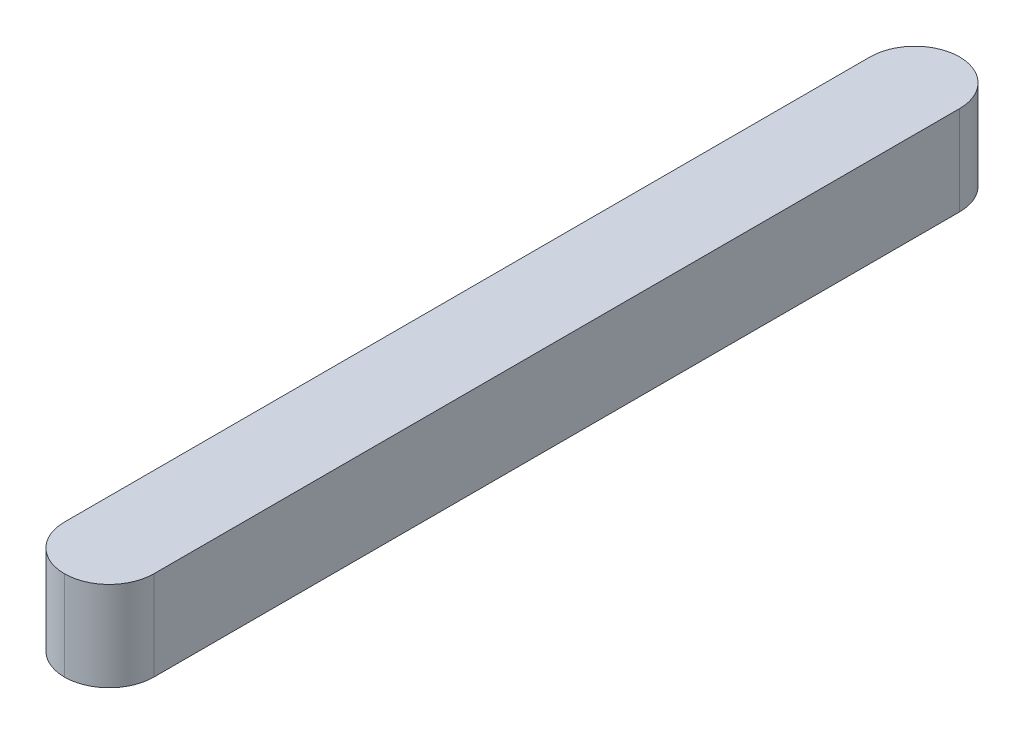
ISO-10303-21;
HEADER;
FILE_DESCRIPTION(('STEP AP214'),'2;1');
FILE_NAME('part.step','',(''),(''),'','','');
FILE_SCHEMA(('AUTOMOTIVE_DESIGN { 1 0 10303 214 1 1 1 1 }'));
ENDSEC;
DATA;
#1=APPLICATION_CONTEXT('core data for automotive mechanical design processes');
#2=APPLICATION_PROTOCOL_DEFINITION('international standard','automotive_design',2000,#1);
#3=PRODUCT_CONTEXT('',#1,'mechanical');
#4=PRODUCT('Part','Part','',(#3));
#5=PRODUCT_RELATED_PRODUCT_CATEGORY('part','',(#4));
#6=PRODUCT_DEFINITION_FORMATION('','',#4);
#7=PRODUCT_DEFINITION_CONTEXT('part definition',#1,'design');
#8=PRODUCT_DEFINITION('design','',#6,#7);
#9=PRODUCT_DEFINITION_SHAPE('','',#8);
#10=(LENGTH_UNIT() NAMED_UNIT(*) SI_UNIT(.MILLI.,.METRE.));
#11=(NAMED_UNIT(*) PLANE_ANGLE_UNIT() SI_UNIT($,.RADIAN.));
#12=(NAMED_UNIT(*) SI_UNIT($,.STERADIAN.) SOLID_ANGLE_UNIT());
#13=UNCERTAINTY_MEASURE_WITH_UNIT(LENGTH_MEASURE(1.E-05),#10,'distance_accuracy_value','');
#14=(GEOMETRIC_REPRESENTATION_CONTEXT(3) GLOBAL_UNCERTAINTY_ASSIGNED_CONTEXT((#13)) GLOBAL_UNIT_ASSIGNED_CONTEXT((#10,
#11,#12)) REPRESENTATION_CONTEXT('',''));
#15=CARTESIAN_POINT('',(0.,0.,0.));
#16=DIRECTION('',(0.,0.,1.));
#17=DIRECTION('',(1.,0.,0.));
#18=AXIS2_PLACEMENT_3D('',#15,#16,#17);
#19=CARTESIAN_POINT('',(1.,-1.,10.));
#20=DIRECTION('',(-1.,0.,0.));
#21=DIRECTION('',(0.,0.,1.));
#22=AXIS2_PLACEMENT_3D('',#19,#20,#21);
#23=PLANE('',#22);
#24=DIRECTION('',(0.,0.,-1.));
#25=VECTOR('',#24,1.);
#26=CARTESIAN_POINT('',(1.,-1.,10.));
#27=LINE('',#26,#25);
#28=CARTESIAN_POINT('',(1.,-1.,9.));
#29=VERTEX_POINT('',#28);
#30=CARTESIAN_POINT('',(1.,-1.,-9.));
#31=VERTEX_POINT('',#30);
#32=EDGE_CURVE('E11',#29,#31,#27,.T.);
#33=ORIENTED_EDGE('',*,*,#32,.T.);
#34=DIRECTION('',(0.,1.,0.));
#35=VECTOR('',#34,1.);
#36=CARTESIAN_POINT('',(1.,1.,-9.));
#37=LINE('',#36,#35);
#38=CARTESIAN_POINT('',(1.,1.,-9.));
#39=VERTEX_POINT('',#38);
#40=EDGE_CURVE('E27',#31,#39,#37,.T.);
#41=ORIENTED_EDGE('',*,*,#40,.T.);
#42=DIRECTION('',(0.,0.,-1.));
#43=VECTOR('',#42,1.);
#44=CARTESIAN_POINT('',(1.,1.,10.));
#45=LINE('',#44,#43);
#46=CARTESIAN_POINT('',(1.,1.,9.));
#47=VERTEX_POINT('',#46);
#48=EDGE_CURVE('E97',#47,#39,#45,.T.);
#49=ORIENTED_EDGE('',*,*,#48,.F.);
#50=DIRECTION('',(0.,-1.,0.));
#51=VECTOR('',#50,1.);
#52=CARTESIAN_POINT('',(1.,-1.,9.));
#53=LINE('',#52,#51);
#54=EDGE_CURVE('E93',#47,#29,#53,.T.);
#55=ORIENTED_EDGE('',*,*,#54,.T.);
#56=EDGE_LOOP('',(#33,#41,#49,#55));
#57=FACE_BOUND('',#56,.T.);
#58=ADVANCED_FACE('F16',(#57),#23,.F.);
#59=CARTESIAN_POINT('',(-1.,1.,10.));
#60=DIRECTION('',(0.,-1.,0.));
#61=DIRECTION('',(0.,0.,-1.));
#62=AXIS2_PLACEMENT_3D('',#59,#60,#61);
#63=PLANE('',#62);
#64=CARTESIAN_POINT('',(0.,1.,-9.));
#65=DIRECTION('',(0.,1.,0.));
#66=DIRECTION('',(0.,0.,-1.));
#67=AXIS2_PLACEMENT_3D('',#64,#65,#66);
#68=CIRCLE('',#67,1.);
#69=CARTESIAN_POINT('',(0.,1.,-10.));
#70=VERTEX_POINT('',#69);
#71=EDGE_CURVE('E106',#39,#70,#68,.T.);
#72=ORIENTED_EDGE('',*,*,#71,.T.);
#73=CARTESIAN_POINT('',(0.,1.,-9.));
#74=DIRECTION('',(0.,1.,0.));
#75=DIRECTION('',(0.,0.,-1.));
#76=AXIS2_PLACEMENT_3D('',#73,#74,#75);
#77=CIRCLE('',#76,1.);
#78=CARTESIAN_POINT('',(-1.,1.,-9.));
#79=VERTEX_POINT('',#78);
#80=EDGE_CURVE('E117',#70,#79,#77,.T.);
#81=ORIENTED_EDGE('',*,*,#80,.T.);
#82=DIRECTION('',(0.,0.,-1.));
#83=VECTOR('',#82,1.);
#84=CARTESIAN_POINT('',(-1.,1.,10.));
#85=LINE('',#84,#83);
#86=CARTESIAN_POINT('',(-1.,1.,9.));
#87=VERTEX_POINT('',#86);
#88=EDGE_CURVE('E74',#87,#79,#85,.T.);
#89=ORIENTED_EDGE('',*,*,#88,.F.);
#90=CARTESIAN_POINT('',(0.,1.,9.));
#91=DIRECTION('',(0.,1.,0.));
#92=DIRECTION('',(0.,0.,-1.));
#93=AXIS2_PLACEMENT_3D('',#90,#91,#92);
#94=CIRCLE('',#93,1.);
#95=CARTESIAN_POINT('',(0.,1.,10.));
#96=VERTEX_POINT('',#95);
#97=EDGE_CURVE('E109',#87,#96,#94,.T.);
#98=ORIENTED_EDGE('',*,*,#97,.T.);
#99=CARTESIAN_POINT('',(0.,1.,9.));
#100=DIRECTION('',(0.,1.,0.));
#101=DIRECTION('',(0.,0.,-1.));
#102=AXIS2_PLACEMENT_3D('',#99,#100,#101);
#103=CIRCLE('',#102,1.);
#104=EDGE_CURVE('E86',#96,#47,#103,.T.);
#105=ORIENTED_EDGE('',*,*,#104,.T.);
#106=ORIENTED_EDGE('',*,*,#48,.T.);
#107=EDGE_LOOP('',(#72,#81,#89,#98,#105,#106));
#108=FACE_BOUND('',#107,.T.);
#109=ADVANCED_FACE('F108',(#108),#63,.F.);
#110=CARTESIAN_POINT('',(-1.,-1.,10.));
#111=DIRECTION('',(1.,0.,0.));
#112=DIRECTION('',(0.,1.,0.));
#113=AXIS2_PLACEMENT_3D('',#110,#111,#112);
#114=PLANE('',#113);
#115=ORIENTED_EDGE('',*,*,#88,.T.);
#116=DIRECTION('',(0.,-1.,0.));
#117=VECTOR('',#116,1.);
#118=CARTESIAN_POINT('',(-1.,-1.,-9.));
#119=LINE('',#118,#117);
#120=CARTESIAN_POINT('',(-1.,-1.,-9.));
#121=VERTEX_POINT('',#120);
#122=EDGE_CURVE('E123',#79,#121,#119,.T.);
#123=ORIENTED_EDGE('',*,*,#122,.T.);
#124=DIRECTION('',(0.,0.,-1.));
#125=VECTOR('',#124,1.);
#126=CARTESIAN_POINT('',(-1.,-1.,10.));
#127=LINE('',#126,#125);
#128=CARTESIAN_POINT('',(-1.,-1.,9.));
#129=VERTEX_POINT('',#128);
#130=EDGE_CURVE('E137',#129,#121,#127,.T.);
#131=ORIENTED_EDGE('',*,*,#130,.F.);
#132=DIRECTION('',(0.,1.,0.));
#133=VECTOR('',#132,1.);
#134=CARTESIAN_POINT('',(-1.,-1.,9.));
#135=LINE('',#134,#133);
#136=EDGE_CURVE('E126',#129,#87,#135,.T.);
#137=ORIENTED_EDGE('',*,*,#136,.T.);
#138=EDGE_LOOP('',(#115,#123,#131,#137));
#139=FACE_BOUND('',#138,.T.);
#140=ADVANCED_FACE('F198',(#139),#114,.F.);
#141=CARTESIAN_POINT('',(-1.,-1.,10.));
#142=DIRECTION('',(0.,1.,0.));
#143=DIRECTION('',(1.,0.,0.));
#144=AXIS2_PLACEMENT_3D('',#141,#142,#143);
#145=PLANE('',#144);
#146=ORIENTED_EDGE('',*,*,#130,.T.);
#147=CARTESIAN_POINT('',(0.,-1.,-9.));
#148=DIRECTION('',(0.,-1.,0.));
#149=DIRECTION('',(0.,0.,1.));
#150=AXIS2_PLACEMENT_3D('',#147,#148,#149);
#151=CIRCLE('',#150,1.);
#152=CARTESIAN_POINT('',(0.,-1.,-10.));
#153=VERTEX_POINT('',#152);
#154=EDGE_CURVE('E142',#121,#153,#151,.T.);
#155=ORIENTED_EDGE('',*,*,#154,.T.);
#156=CARTESIAN_POINT('',(0.,-1.,-9.));
#157=DIRECTION('',(0.,-1.,0.));
#158=DIRECTION('',(0.,0.,1.));
#159=AXIS2_PLACEMENT_3D('',#156,#157,#158);
#160=CIRCLE('',#159,1.);
#161=EDGE_CURVE('E147',#153,#31,#160,.T.);
#162=ORIENTED_EDGE('',*,*,#161,.T.);
#163=ORIENTED_EDGE('',*,*,#32,.F.);
#164=CARTESIAN_POINT('',(0.,-1.,9.));
#165=DIRECTION('',(0.,-1.,0.));
#166=DIRECTION('',(0.,0.,1.));
#167=AXIS2_PLACEMENT_3D('',#164,#165,#166);
#168=CIRCLE('',#167,1.);
#169=CARTESIAN_POINT('',(0.,-1.,10.));
#170=VERTEX_POINT('',#169);
#171=EDGE_CURVE('E104',#29,#170,#168,.T.);
#172=ORIENTED_EDGE('',*,*,#171,.T.);
#173=CARTESIAN_POINT('',(0.,-1.,9.));
#174=DIRECTION('',(0.,-1.,0.));
#175=DIRECTION('',(0.,0.,1.));
#176=AXIS2_PLACEMENT_3D('',#173,#174,#175);
#177=CIRCLE('',#176,1.);
#178=EDGE_CURVE('E20',#170,#129,#177,.T.);
#179=ORIENTED_EDGE('',*,*,#178,.T.);
#180=EDGE_LOOP('',(#146,#155,#162,#163,#172,#179));
#181=FACE_BOUND('',#180,.T.);
#182=ADVANCED_FACE('F172',(#181),#145,.F.);
#183=CARTESIAN_POINT('',(0.,-1.,-9.));
#184=DIRECTION('',(0.,-1.,0.));
#185=DIRECTION('',(0.,0.,-1.));
#186=AXIS2_PLACEMENT_3D('',#183,#184,#185);
#187=CYLINDRICAL_SURFACE('',#186,1.);
#188=DIRECTION('',(0.,-1.,0.));
#189=VECTOR('',#188,1.);
#190=CARTESIAN_POINT('',(0.,-1.,-10.));
#191=LINE('',#190,#189);
#192=EDGE_CURVE('E156',#70,#153,#191,.T.);
#193=ORIENTED_EDGE('',*,*,#192,.F.);
#194=ORIENTED_EDGE('',*,*,#71,.F.);
#195=ORIENTED_EDGE('',*,*,#40,.F.);
#196=ORIENTED_EDGE('',*,*,#161,.F.);
#197=EDGE_LOOP('',(#193,#194,#195,#196));
#198=FACE_BOUND('',#197,.T.);
#199=ADVANCED_FACE('F182',(#198),#187,.T.);
#200=CARTESIAN_POINT('',(0.,-1.,-9.));
#201=DIRECTION('',(0.,1.,0.));
#202=DIRECTION('',(0.,0.,1.));
#203=AXIS2_PLACEMENT_3D('',#200,#201,#202);
#204=CYLINDRICAL_SURFACE('',#203,1.);
#205=ORIENTED_EDGE('',*,*,#80,.F.);
#206=ORIENTED_EDGE('',*,*,#192,.T.);
#207=ORIENTED_EDGE('',*,*,#154,.F.);
#208=ORIENTED_EDGE('',*,*,#122,.F.);
#209=EDGE_LOOP('',(#205,#206,#207,#208));
#210=FACE_BOUND('',#209,.T.);
#211=ADVANCED_FACE('F183',(#210),#204,.T.);
#212=CARTESIAN_POINT('',(0.,1.,9.));
#213=DIRECTION('',(0.,1.,0.));
#214=DIRECTION('',(0.,0.,1.));
#215=AXIS2_PLACEMENT_3D('',#212,#213,#214);
#216=CYLINDRICAL_SURFACE('',#215,1.);
#217=ORIENTED_EDGE('',*,*,#54,.F.);
#218=ORIENTED_EDGE('',*,*,#104,.F.);
#219=DIRECTION('',(0.,1.,0.));
#220=VECTOR('',#219,1.);
#221=CARTESIAN_POINT('',(0.,1.,10.));
#222=LINE('',#221,#220);
#223=EDGE_CURVE('E153',#170,#96,#222,.T.);
#224=ORIENTED_EDGE('',*,*,#223,.F.);
#225=ORIENTED_EDGE('',*,*,#171,.F.);
#226=EDGE_LOOP('',(#217,#218,#224,#225));
#227=FACE_BOUND('',#226,.T.);
#228=ADVANCED_FACE('F102',(#227),#216,.T.);
#229=CARTESIAN_POINT('',(0.,1.,9.));
#230=DIRECTION('',(0.,-1.,0.));
#231=DIRECTION('',(0.,0.,-1.));
#232=AXIS2_PLACEMENT_3D('',#229,#230,#231);
#233=CYLINDRICAL_SURFACE('',#232,1.);
#234=ORIENTED_EDGE('',*,*,#97,.F.);
#235=ORIENTED_EDGE('',*,*,#136,.F.);
#236=ORIENTED_EDGE('',*,*,#178,.F.);
#237=ORIENTED_EDGE('',*,*,#223,.T.);
#238=EDGE_LOOP('',(#234,#235,#236,#237));
#239=FACE_BOUND('',#238,.T.);
#240=ADVANCED_FACE('F18',(#239),#233,.T.);
#241=CLOSED_SHELL('',(#58,#109,#140,#182,#199,#211,#228,#240));
#242=MANIFOLD_SOLID_BREP('B1',#241);
#243=ADVANCED_BREP_SHAPE_REPRESENTATION('',(#18,#242),#14);
#244=SHAPE_DEFINITION_REPRESENTATION(#9,#243);
ENDSEC;
END-ISO-10303-21;
